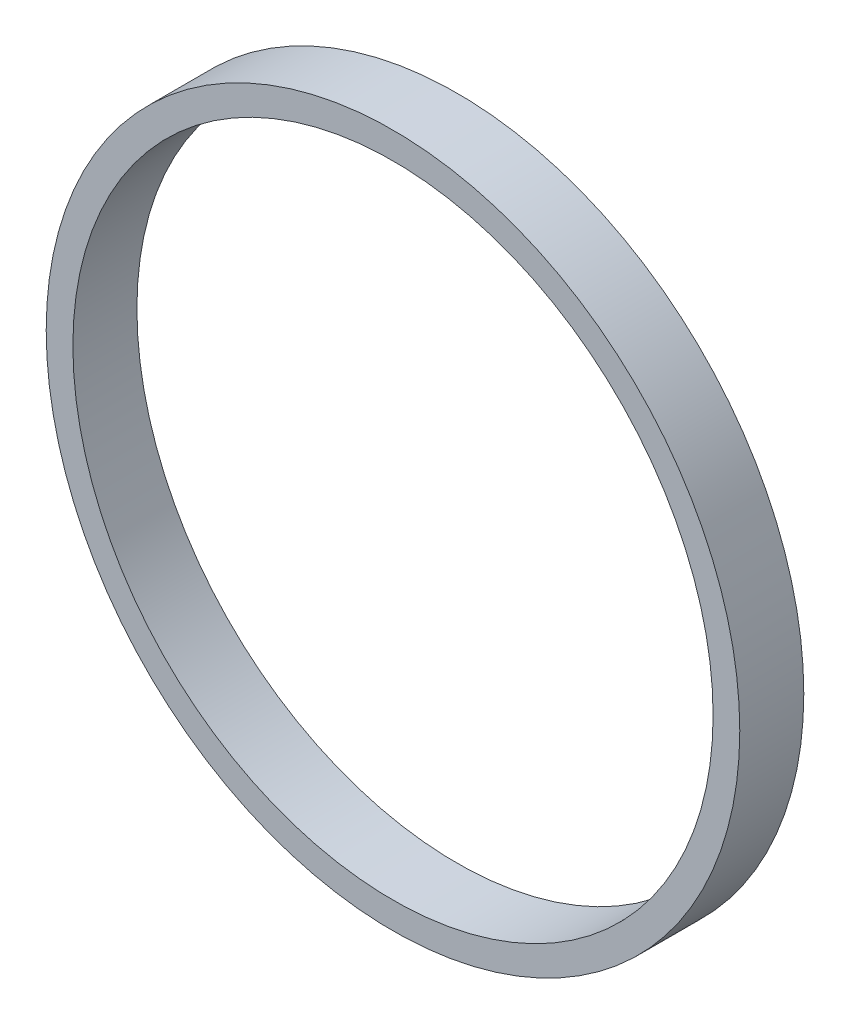
ISO-10303-21;
HEADER;
FILE_DESCRIPTION(('STEP AP214'),'2;1');
FILE_NAME('part.step','',(''),(''),'','','');
FILE_SCHEMA(('AUTOMOTIVE_DESIGN { 1 0 10303 214 1 1 1 1 }'));
ENDSEC;
DATA;
#1=APPLICATION_CONTEXT('core data for automotive mechanical design processes');
#2=APPLICATION_PROTOCOL_DEFINITION('international standard','automotive_design',2000,#1);
#3=PRODUCT_CONTEXT('',#1,'mechanical');
#4=PRODUCT('Part','Part','',(#3));
#5=PRODUCT_RELATED_PRODUCT_CATEGORY('part','',(#4));
#6=PRODUCT_DEFINITION_FORMATION('','',#4);
#7=PRODUCT_DEFINITION_CONTEXT('part definition',#1,'design');
#8=PRODUCT_DEFINITION('design','',#6,#7);
#9=PRODUCT_DEFINITION_SHAPE('','',#8);
#10=(LENGTH_UNIT() NAMED_UNIT(*) SI_UNIT(.MILLI.,.METRE.));
#11=(NAMED_UNIT(*) PLANE_ANGLE_UNIT() SI_UNIT($,.RADIAN.));
#12=(NAMED_UNIT(*) SI_UNIT($,.STERADIAN.) SOLID_ANGLE_UNIT());
#13=UNCERTAINTY_MEASURE_WITH_UNIT(LENGTH_MEASURE(1.E-05),#10,'distance_accuracy_value','');
#14=(GEOMETRIC_REPRESENTATION_CONTEXT(3) GLOBAL_UNCERTAINTY_ASSIGNED_CONTEXT((#13)) GLOBAL_UNIT_ASSIGNED_CONTEXT((#10,
#11,#12)) REPRESENTATION_CONTEXT('',''));
#15=CARTESIAN_POINT('',(0.,0.,0.));
#16=DIRECTION('',(0.,0.,1.));
#17=DIRECTION('',(1.,0.,0.));
#18=AXIS2_PLACEMENT_3D('',#15,#16,#17);
#19=CARTESIAN_POINT('',(0.,0.,3.));
#20=DIRECTION('',(0.,0.,1.));
#21=DIRECTION('',(1.,0.,0.));
#22=AXIS2_PLACEMENT_3D('',#19,#20,#21);
#23=PLANE('',#22);
#24=CARTESIAN_POINT('',(0.,0.,3.));
#25=DIRECTION('',(0.,0.,1.));
#26=DIRECTION('',(1.,0.,0.));
#27=AXIS2_PLACEMENT_3D('',#24,#25,#26);
#28=CIRCLE('',#27,32.5);
#29=CARTESIAN_POINT('',(32.5,0.,3.));
#30=VERTEX_POINT('',#29);
#31=EDGE_CURVE('E10',#30,#30,#28,.T.);
#32=ORIENTED_EDGE('',*,*,#31,.T.);
#33=EDGE_LOOP('',(#32));
#34=FACE_BOUND('',#33,.T.);
#35=CARTESIAN_POINT('',(0.,0.,3.));
#36=DIRECTION('',(0.,0.,1.));
#37=DIRECTION('',(1.,0.,0.));
#38=AXIS2_PLACEMENT_3D('',#35,#36,#37);
#39=CIRCLE('',#38,30.);
#40=CARTESIAN_POINT('',(30.,0.,3.));
#41=VERTEX_POINT('',#40);
#42=EDGE_CURVE('E54',#41,#41,#39,.T.);
#43=ORIENTED_EDGE('',*,*,#42,.F.);
#44=EDGE_LOOP('',(#43));
#45=FACE_BOUND('',#44,.T.);
#46=ADVANCED_FACE('F41',(#34,#45),#23,.T.);
#47=CARTESIAN_POINT('',(0.,0.,-3.));
#48=DIRECTION('',(0.,0.,1.));
#49=DIRECTION('',(1.,0.,0.));
#50=AXIS2_PLACEMENT_3D('',#47,#48,#49);
#51=PLANE('',#50);
#52=CARTESIAN_POINT('',(0.,0.,-3.));
#53=DIRECTION('',(0.,0.,1.));
#54=DIRECTION('',(1.,0.,0.));
#55=AXIS2_PLACEMENT_3D('',#52,#53,#54);
#56=CIRCLE('',#55,32.5);
#57=CARTESIAN_POINT('',(32.5,0.,-3.));
#58=VERTEX_POINT('',#57);
#59=EDGE_CURVE('E45',#58,#58,#56,.T.);
#60=ORIENTED_EDGE('',*,*,#59,.F.);
#61=EDGE_LOOP('',(#60));
#62=FACE_BOUND('',#61,.T.);
#63=CARTESIAN_POINT('',(0.,0.,-3.));
#64=DIRECTION('',(0.,0.,1.));
#65=DIRECTION('',(1.,0.,0.));
#66=AXIS2_PLACEMENT_3D('',#63,#64,#65);
#67=CIRCLE('',#66,30.);
#68=CARTESIAN_POINT('',(30.,0.,-3.));
#69=VERTEX_POINT('',#68);
#70=EDGE_CURVE('E56',#69,#69,#67,.T.);
#71=ORIENTED_EDGE('',*,*,#70,.T.);
#72=EDGE_LOOP('',(#71));
#73=FACE_BOUND('',#72,.T.);
#74=ADVANCED_FACE('F68',(#62,#73),#51,.F.);
#75=CARTESIAN_POINT('',(0.,0.,3.));
#76=DIRECTION('',(0.,0.,-1.));
#77=DIRECTION('',(-1.,0.,0.));
#78=AXIS2_PLACEMENT_3D('',#75,#76,#77);
#79=CYLINDRICAL_SURFACE('',#78,32.5);
#80=ORIENTED_EDGE('',*,*,#31,.F.);
#81=EDGE_LOOP('',(#80));
#82=FACE_BOUND('',#81,.T.);
#83=ORIENTED_EDGE('',*,*,#59,.T.);
#84=EDGE_LOOP('',(#83));
#85=FACE_BOUND('',#84,.T.);
#86=ADVANCED_FACE('F43',(#82,#85),#79,.T.);
#87=CARTESIAN_POINT('',(0.,0.,3.));
#88=DIRECTION('',(0.,0.,-1.));
#89=DIRECTION('',(-1.,0.,0.));
#90=AXIS2_PLACEMENT_3D('',#87,#88,#89);
#91=CYLINDRICAL_SURFACE('',#90,30.);
#92=ORIENTED_EDGE('',*,*,#42,.T.);
#93=EDGE_LOOP('',(#92));
#94=FACE_BOUND('',#93,.T.);
#95=ORIENTED_EDGE('',*,*,#70,.F.);
#96=EDGE_LOOP('',(#95));
#97=FACE_BOUND('',#96,.T.);
#98=ADVANCED_FACE('F64',(#94,#97),#91,.F.);
#99=CLOSED_SHELL('',(#46,#74,#86,#98));
#100=MANIFOLD_SOLID_BREP('B2',#99);
#101=ADVANCED_BREP_SHAPE_REPRESENTATION('',(#18,#100),#14);
#102=SHAPE_DEFINITION_REPRESENTATION(#9,#101);
ENDSEC;
END-ISO-10303-21;
